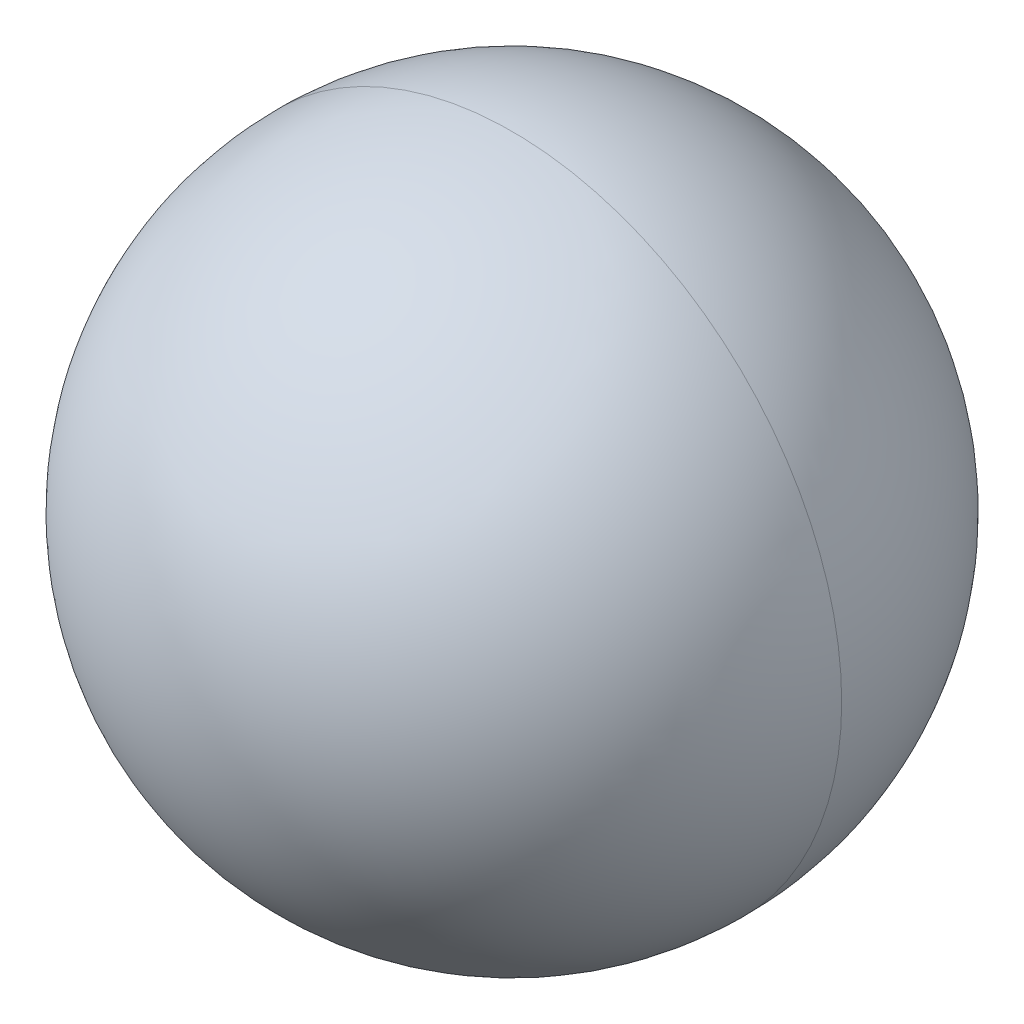
ISO-10303-21;
HEADER;
FILE_DESCRIPTION(('STEP AP214'),'2;1');
FILE_NAME('part.step','',(''),(''),'','','');
FILE_SCHEMA(('AUTOMOTIVE_DESIGN { 1 0 10303 214 1 1 1 1 }'));
ENDSEC;
DATA;
#1=APPLICATION_CONTEXT('core data for automotive mechanical design processes');
#2=APPLICATION_PROTOCOL_DEFINITION('international standard','automotive_design',2000,#1);
#3=PRODUCT_CONTEXT('',#1,'mechanical');
#4=PRODUCT('Part','Part','',(#3));
#5=PRODUCT_RELATED_PRODUCT_CATEGORY('part','',(#4));
#6=PRODUCT_DEFINITION_FORMATION('','',#4);
#7=PRODUCT_DEFINITION_CONTEXT('part definition',#1,'design');
#8=PRODUCT_DEFINITION('design','',#6,#7);
#9=PRODUCT_DEFINITION_SHAPE('','',#8);
#10=(LENGTH_UNIT() NAMED_UNIT(*) SI_UNIT(.MILLI.,.METRE.));
#11=(NAMED_UNIT(*) PLANE_ANGLE_UNIT() SI_UNIT($,.RADIAN.));
#12=(NAMED_UNIT(*) SI_UNIT($,.STERADIAN.) SOLID_ANGLE_UNIT());
#13=UNCERTAINTY_MEASURE_WITH_UNIT(LENGTH_MEASURE(1.E-05),#10,'distance_accuracy_value','');
#14=(GEOMETRIC_REPRESENTATION_CONTEXT(3) GLOBAL_UNCERTAINTY_ASSIGNED_CONTEXT((#13)) GLOBAL_UNIT_ASSIGNED_CONTEXT((#10,
#11,#12)) REPRESENTATION_CONTEXT('',''));
#15=CARTESIAN_POINT('',(0.,0.,0.));
#16=DIRECTION('',(0.,0.,1.));
#17=DIRECTION('',(1.,0.,0.));
#18=AXIS2_PLACEMENT_3D('',#15,#16,#17);
#19=CARTESIAN_POINT('',(8.,21.5,0.));
#20=DIRECTION('',(1.,0.,0.));
#21=DIRECTION('',(0.,0.,-1.));
#22=AXIS2_PLACEMENT_3D('',#19,#20,#21);
#23=SPHERICAL_SURFACE('',#22,4.3655);
#24=CARTESIAN_POINT('',(8.,21.5,0.));
#25=DIRECTION('',(0.,0.,1.));
#26=DIRECTION('',(1.,0.,0.));
#27=AXIS2_PLACEMENT_3D('',#24,#25,#26);
#28=CIRCLE('',#27,4.3655);
#29=CARTESIAN_POINT('',(12.3655,21.5,0.));
#30=VERTEX_POINT('',#29);
#31=CARTESIAN_POINT('',(3.6345,21.5,0.));
#32=VERTEX_POINT('',#31);
#33=EDGE_CURVE('E11',#30,#32,#28,.T.);
#34=ORIENTED_EDGE('',*,*,#33,.T.);
#35=CARTESIAN_POINT('',(8.,21.5,0.));
#36=DIRECTION('',(0.,0.,-1.));
#37=DIRECTION('',(1.,0.,0.));
#38=AXIS2_PLACEMENT_3D('',#35,#36,#37);
#39=CIRCLE('',#38,4.3655);
#40=EDGE_CURVE('E25',#30,#32,#39,.T.);
#41=ORIENTED_EDGE('',*,*,#40,.F.);
#42=EDGE_LOOP('',(#34,#41));
#43=FACE_BOUND('',#42,.T.);
#44=ADVANCED_FACE('F17',(#43),#23,.T.);
#45=CARTESIAN_POINT('',(8.,21.5,0.));
#46=DIRECTION('',(1.,0.,0.));
#47=DIRECTION('',(0.,0.,1.));
#48=AXIS2_PLACEMENT_3D('',#45,#46,#47);
#49=SPHERICAL_SURFACE('',#48,4.3655);
#50=ORIENTED_EDGE('',*,*,#33,.F.);
#51=ORIENTED_EDGE('',*,*,#40,.T.);
#52=EDGE_LOOP('',(#50,#51));
#53=FACE_BOUND('',#52,.T.);
#54=ADVANCED_FACE('F33',(#53),#49,.T.);
#55=CLOSED_SHELL('',(#44,#54));
#56=MANIFOLD_SOLID_BREP('B1',#55);
#57=ADVANCED_BREP_SHAPE_REPRESENTATION('',(#18,#56),#14);
#58=SHAPE_DEFINITION_REPRESENTATION(#9,#57);
ENDSEC;
END-ISO-10303-21;
